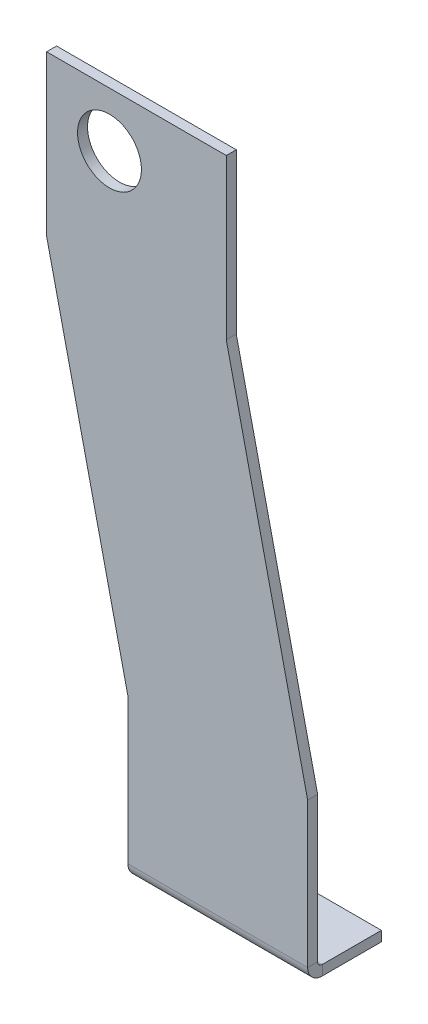
ISO-10303-21;
HEADER;
FILE_DESCRIPTION(('STEP AP214'),'2;1');
FILE_NAME('part.step','',(''),(''),'','','');
FILE_SCHEMA(('AUTOMOTIVE_DESIGN { 1 0 10303 214 1 1 1 1 }'));
ENDSEC;
DATA;
#1=APPLICATION_CONTEXT('core data for automotive mechanical design processes');
#2=APPLICATION_PROTOCOL_DEFINITION('international standard','automotive_design',2000,#1);
#3=PRODUCT_CONTEXT('',#1,'mechanical');
#4=PRODUCT('Part','Part','',(#3));
#5=PRODUCT_RELATED_PRODUCT_CATEGORY('part','',(#4));
#6=PRODUCT_DEFINITION_FORMATION('','',#4);
#7=PRODUCT_DEFINITION_CONTEXT('part definition',#1,'design');
#8=PRODUCT_DEFINITION('design','',#6,#7);
#9=PRODUCT_DEFINITION_SHAPE('','',#8);
#10=(LENGTH_UNIT() NAMED_UNIT(*) SI_UNIT(.MILLI.,.METRE.));
#11=(NAMED_UNIT(*) PLANE_ANGLE_UNIT() SI_UNIT($,.RADIAN.));
#12=(NAMED_UNIT(*) SI_UNIT($,.STERADIAN.) SOLID_ANGLE_UNIT());
#13=UNCERTAINTY_MEASURE_WITH_UNIT(LENGTH_MEASURE(1.E-05),#10,'distance_accuracy_value','');
#14=(GEOMETRIC_REPRESENTATION_CONTEXT(3) GLOBAL_UNCERTAINTY_ASSIGNED_CONTEXT((#13)) GLOBAL_UNIT_ASSIGNED_CONTEXT((#10,
#11,#12)) REPRESENTATION_CONTEXT('',''));
#15=CARTESIAN_POINT('',(0.,0.,0.));
#16=DIRECTION('',(0.,0.,1.));
#17=DIRECTION('',(1.,0.,0.));
#18=AXIS2_PLACEMENT_3D('',#15,#16,#17);
#19=CARTESIAN_POINT('',(12.93876,-82.30362,-1.5875));
#20=DIRECTION('',(-1.,0.,0.));
#21=DIRECTION('',(0.,-1.,0.));
#22=AXIS2_PLACEMENT_3D('',#19,#20,#21);
#23=PLANE('',#22);
#24=DIRECTION('',(0.,-1.,0.));
#25=VECTOR('',#24,1.);
#26=CARTESIAN_POINT('',(12.93876,-82.30362,-1.5875));
#27=LINE('',#26,#25);
#28=CARTESIAN_POINT('',(12.93876,-82.30362,-1.5875));
#29=VERTEX_POINT('',#28);
#30=CARTESIAN_POINT('',(12.93876,-105.37952,-1.58750000000001));
#31=VERTEX_POINT('',#30);
#32=EDGE_CURVE('E157',#29,#31,#27,.T.);
#33=ORIENTED_EDGE('',*,*,#32,.T.);
#34=DIRECTION('',(0.,0.,1.));
#35=VECTOR('',#34,1.);
#36=CARTESIAN_POINT('',(12.93876,-105.37952,-1.58750000000001));
#37=LINE('',#36,#35);
#38=CARTESIAN_POINT('',(12.93876,-105.37952,0.));
#39=VERTEX_POINT('',#38);
#40=EDGE_CURVE('E233',#31,#39,#37,.T.);
#41=ORIENTED_EDGE('',*,*,#40,.T.);
#42=DIRECTION('',(0.,-1.,0.));
#43=VECTOR('',#42,1.);
#44=CARTESIAN_POINT('',(12.93876,-82.30362,0.));
#45=LINE('',#44,#43);
#46=CARTESIAN_POINT('',(12.93876,-82.30362,0.));
#47=VERTEX_POINT('',#46);
#48=EDGE_CURVE('E169',#47,#39,#45,.T.);
#49=ORIENTED_EDGE('',*,*,#48,.F.);
#50=DIRECTION('',(0.,0.,1.));
#51=VECTOR('',#50,1.);
#52=CARTESIAN_POINT('',(12.93876,-82.30362,-1.5875));
#53=LINE('',#52,#51);
#54=EDGE_CURVE('E182',#29,#47,#53,.T.);
#55=ORIENTED_EDGE('',*,*,#54,.F.);
#56=EDGE_LOOP('',(#33,#41,#49,#55));
#57=FACE_BOUND('',#56,.T.);
#58=ADVANCED_FACE('F61',(#57),#23,.T.);
#59=CARTESIAN_POINT('',(0.,0.,-1.5875));
#60=DIRECTION('',(0.,0.,1.));
#61=DIRECTION('',(1.,0.,0.));
#62=AXIS2_PLACEMENT_3D('',#59,#60,#61);
#63=PLANE('',#62);
#64=CARTESIAN_POINT('',(9.99998,-8.6741,-1.5875));
#65=DIRECTION('',(0.,0.,1.));
#66=DIRECTION('',(1.,0.,0.));
#67=AXIS2_PLACEMENT_3D('',#64,#65,#66);
#68=CIRCLE('',#67,5.08000000000001);
#69=CARTESIAN_POINT('',(15.07998,-8.6741,-1.5875));
#70=VERTEX_POINT('',#69);
#71=EDGE_CURVE('E166',#70,#70,#68,.T.);
#72=ORIENTED_EDGE('',*,*,#71,.T.);
#73=EDGE_LOOP('',(#72));
#74=FACE_BOUND('',#73,.T.);
#75=DIRECTION('',(-1.,0.,0.));
#76=VECTOR('',#75,1.);
#77=CARTESIAN_POINT('',(12.93876,-105.37952,-1.58750000000001));
#78=LINE('',#77,#76);
#79=CARTESIAN_POINT('',(41.51376,-105.37952,-1.58750000000001));
#80=VERTEX_POINT('',#79);
#81=EDGE_CURVE('E236',#31,#80,#78,.F.);
#82=ORIENTED_EDGE('',*,*,#81,.F.);
#83=ORIENTED_EDGE('',*,*,#32,.F.);
#84=DIRECTION('',(0.221720810035318,-0.975110189874602,0.));
#85=VECTOR('',#84,1.);
#86=CARTESIAN_POINT('',(0.,-25.4,-1.5875));
#87=LINE('',#86,#85);
#88=CARTESIAN_POINT('',(0.,-25.4,-1.5875));
#89=VERTEX_POINT('',#88);
#90=EDGE_CURVE('E246',#89,#29,#87,.T.);
#91=ORIENTED_EDGE('',*,*,#90,.F.);
#92=DIRECTION('',(0.,-1.,0.));
#93=VECTOR('',#92,1.);
#94=CARTESIAN_POINT('',(0.,0.,-1.5875));
#95=LINE('',#94,#93);
#96=CARTESIAN_POINT('',(0.,0.,-1.5875));
#97=VERTEX_POINT('',#96);
#98=EDGE_CURVE('E179',#97,#89,#95,.T.);
#99=ORIENTED_EDGE('',*,*,#98,.F.);
#100=DIRECTION('',(-1.,0.,0.));
#101=VECTOR('',#100,1.);
#102=CARTESIAN_POINT('',(0.,0.,-1.5875));
#103=LINE('',#102,#101);
#104=CARTESIAN_POINT('',(28.575,0.,-1.5875));
#105=VERTEX_POINT('',#104);
#106=EDGE_CURVE('E150',#105,#97,#103,.T.);
#107=ORIENTED_EDGE('',*,*,#106,.F.);
#108=DIRECTION('',(0.,1.,0.));
#109=VECTOR('',#108,1.);
#110=CARTESIAN_POINT('',(28.575,0.,-1.5875));
#111=LINE('',#110,#109);
#112=CARTESIAN_POINT('',(28.575,-25.4,-1.5875));
#113=VERTEX_POINT('',#112);
#114=EDGE_CURVE('E134',#113,#105,#111,.T.);
#115=ORIENTED_EDGE('',*,*,#114,.F.);
#116=DIRECTION('',(-0.221720810035318,0.975110189874602,0.));
#117=VECTOR('',#116,1.);
#118=CARTESIAN_POINT('',(41.51376,-82.30362,-1.5875));
#119=LINE('',#118,#117);
#120=CARTESIAN_POINT('',(41.51376,-82.30362,-1.5875));
#121=VERTEX_POINT('',#120);
#122=EDGE_CURVE('E149',#121,#113,#119,.T.);
#123=ORIENTED_EDGE('',*,*,#122,.F.);
#124=DIRECTION('',(0.,1.,0.));
#125=VECTOR('',#124,1.);
#126=CARTESIAN_POINT('',(41.51376,-107.70362,-1.5875));
#127=LINE('',#126,#125);
#128=EDGE_CURVE('E155',#80,#121,#127,.T.);
#129=ORIENTED_EDGE('',*,*,#128,.F.);
#130=EDGE_LOOP('',(#82,#83,#91,#99,#107,#115,#123,#129));
#131=FACE_BOUND('',#130,.T.);
#132=ADVANCED_FACE('F147',(#74,#131),#63,.F.);
#133=CARTESIAN_POINT('',(0.,0.,0.));
#134=DIRECTION('',(0.,0.,1.));
#135=DIRECTION('',(1.,0.,0.));
#136=AXIS2_PLACEMENT_3D('',#133,#134,#135);
#137=PLANE('',#136);
#138=CARTESIAN_POINT('',(9.99998,-8.6741,0.));
#139=DIRECTION('',(0.,0.,1.));
#140=DIRECTION('',(1.,0.,0.));
#141=AXIS2_PLACEMENT_3D('',#138,#139,#140);
#142=CIRCLE('',#141,5.08000000000001);
#143=CARTESIAN_POINT('',(15.07998,-8.6741,0.));
#144=VERTEX_POINT('',#143);
#145=EDGE_CURVE('E232',#144,#144,#142,.T.);
#146=ORIENTED_EDGE('',*,*,#145,.F.);
#147=EDGE_LOOP('',(#146));
#148=FACE_BOUND('',#147,.T.);
#149=ORIENTED_EDGE('',*,*,#48,.T.);
#150=DIRECTION('',(-1.,0.,0.));
#151=VECTOR('',#150,1.);
#152=CARTESIAN_POINT('',(12.93876,-105.37952,0.));
#153=LINE('',#152,#151);
#154=CARTESIAN_POINT('',(41.51376,-105.37952,0.));
#155=VERTEX_POINT('',#154);
#156=EDGE_CURVE('E261',#39,#155,#153,.F.);
#157=ORIENTED_EDGE('',*,*,#156,.T.);
#158=DIRECTION('',(0.,1.,0.));
#159=VECTOR('',#158,1.);
#160=CARTESIAN_POINT('',(41.51376,-107.70362,0.));
#161=LINE('',#160,#159);
#162=CARTESIAN_POINT('',(41.51376,-82.30362,0.));
#163=VERTEX_POINT('',#162);
#164=EDGE_CURVE('E172',#155,#163,#161,.T.);
#165=ORIENTED_EDGE('',*,*,#164,.T.);
#166=DIRECTION('',(-0.221720810035318,0.975110189874602,0.));
#167=VECTOR('',#166,1.);
#168=CARTESIAN_POINT('',(41.51376,-82.30362,0.));
#169=LINE('',#168,#167);
#170=CARTESIAN_POINT('',(28.575,-25.4,0.));
#171=VERTEX_POINT('',#170);
#172=EDGE_CURVE('E174',#163,#171,#169,.T.);
#173=ORIENTED_EDGE('',*,*,#172,.T.);
#174=DIRECTION('',(0.,1.,0.));
#175=VECTOR('',#174,1.);
#176=CARTESIAN_POINT('',(28.575,0.,0.));
#177=LINE('',#176,#175);
#178=CARTESIAN_POINT('',(28.575,0.,0.));
#179=VERTEX_POINT('',#178);
#180=EDGE_CURVE('E137',#171,#179,#177,.T.);
#181=ORIENTED_EDGE('',*,*,#180,.T.);
#182=DIRECTION('',(-1.,0.,0.));
#183=VECTOR('',#182,1.);
#184=CARTESIAN_POINT('',(0.,0.,0.));
#185=LINE('',#184,#183);
#186=CARTESIAN_POINT('',(0.,0.,0.));
#187=VERTEX_POINT('',#186);
#188=EDGE_CURVE('E177',#179,#187,#185,.T.);
#189=ORIENTED_EDGE('',*,*,#188,.T.);
#190=DIRECTION('',(0.,-1.,0.));
#191=VECTOR('',#190,1.);
#192=CARTESIAN_POINT('',(0.,0.,0.));
#193=LINE('',#192,#191);
#194=CARTESIAN_POINT('',(0.,-25.4,0.));
#195=VERTEX_POINT('',#194);
#196=EDGE_CURVE('E162',#187,#195,#193,.T.);
#197=ORIENTED_EDGE('',*,*,#196,.T.);
#198=DIRECTION('',(0.221720810035318,-0.975110189874602,0.));
#199=VECTOR('',#198,1.);
#200=CARTESIAN_POINT('',(0.,-25.4,0.));
#201=LINE('',#200,#199);
#202=EDGE_CURVE('E165',#195,#47,#201,.T.);
#203=ORIENTED_EDGE('',*,*,#202,.T.);
#204=EDGE_LOOP('',(#149,#157,#165,#173,#181,#189,#197,#203));
#205=FACE_BOUND('',#204,.T.);
#206=ADVANCED_FACE('F186',(#148,#205),#137,.T.);
#207=CARTESIAN_POINT('',(0.,0.,-1.5875));
#208=DIRECTION('',(-1.,0.,0.));
#209=DIRECTION('',(0.,-1.,0.));
#210=AXIS2_PLACEMENT_3D('',#207,#208,#209);
#211=PLANE('',#210);
#212=ORIENTED_EDGE('',*,*,#196,.F.);
#213=DIRECTION('',(0.,0.,1.));
#214=VECTOR('',#213,1.);
#215=CARTESIAN_POINT('',(0.,0.,-1.5875));
#216=LINE('',#215,#214);
#217=EDGE_CURVE('E13',#97,#187,#216,.T.);
#218=ORIENTED_EDGE('',*,*,#217,.F.);
#219=ORIENTED_EDGE('',*,*,#98,.T.);
#220=DIRECTION('',(0.,0.,1.));
#221=VECTOR('',#220,1.);
#222=CARTESIAN_POINT('',(0.,-25.4,-1.5875));
#223=LINE('',#222,#221);
#224=EDGE_CURVE('E65',#89,#195,#223,.T.);
#225=ORIENTED_EDGE('',*,*,#224,.T.);
#226=EDGE_LOOP('',(#212,#218,#219,#225));
#227=FACE_BOUND('',#226,.T.);
#228=ADVANCED_FACE('F63',(#227),#211,.T.);
#229=CARTESIAN_POINT('',(0.,0.,-1.5875));
#230=DIRECTION('',(0.,1.,0.));
#231=DIRECTION('',(0.,0.,1.));
#232=AXIS2_PLACEMENT_3D('',#229,#230,#231);
#233=PLANE('',#232);
#234=ORIENTED_EDGE('',*,*,#188,.F.);
#235=DIRECTION('',(0.,0.,1.));
#236=VECTOR('',#235,1.);
#237=CARTESIAN_POINT('',(28.575,0.,-1.5875));
#238=LINE('',#237,#236);
#239=EDGE_CURVE('E70',#105,#179,#238,.T.);
#240=ORIENTED_EDGE('',*,*,#239,.F.);
#241=ORIENTED_EDGE('',*,*,#106,.T.);
#242=ORIENTED_EDGE('',*,*,#217,.T.);
#243=EDGE_LOOP('',(#234,#240,#241,#242));
#244=FACE_BOUND('',#243,.T.);
#245=ADVANCED_FACE('F187',(#244),#233,.T.);
#246=CARTESIAN_POINT('',(28.575,0.,-1.5875));
#247=DIRECTION('',(1.,0.,0.));
#248=DIRECTION('',(0.,0.,-1.));
#249=AXIS2_PLACEMENT_3D('',#246,#247,#248);
#250=PLANE('',#249);
#251=ORIENTED_EDGE('',*,*,#180,.F.);
#252=DIRECTION('',(0.,0.,1.));
#253=VECTOR('',#252,1.);
#254=CARTESIAN_POINT('',(28.575,-25.4,-1.5875));
#255=LINE('',#254,#253);
#256=EDGE_CURVE('E131',#113,#171,#255,.T.);
#257=ORIENTED_EDGE('',*,*,#256,.F.);
#258=ORIENTED_EDGE('',*,*,#114,.T.);
#259=ORIENTED_EDGE('',*,*,#239,.T.);
#260=EDGE_LOOP('',(#251,#257,#258,#259));
#261=FACE_BOUND('',#260,.T.);
#262=ADVANCED_FACE('F133',(#261),#250,.T.);
#263=CARTESIAN_POINT('',(41.51376,-82.30362,-1.5875));
#264=DIRECTION('',(0.975110189874602,0.221720810035318,0.));
#265=DIRECTION('',(-0.221720810035318,0.975110189874602,0.));
#266=AXIS2_PLACEMENT_3D('',#263,#264,#265);
#267=PLANE('',#266);
#268=ORIENTED_EDGE('',*,*,#172,.F.);
#269=DIRECTION('',(0.,0.,1.));
#270=VECTOR('',#269,1.);
#271=CARTESIAN_POINT('',(41.51376,-82.30362,-1.5875));
#272=LINE('',#271,#270);
#273=EDGE_CURVE('E142',#121,#163,#272,.T.);
#274=ORIENTED_EDGE('',*,*,#273,.F.);
#275=ORIENTED_EDGE('',*,*,#122,.T.);
#276=ORIENTED_EDGE('',*,*,#256,.T.);
#277=EDGE_LOOP('',(#268,#274,#275,#276));
#278=FACE_BOUND('',#277,.T.);
#279=ADVANCED_FACE('F153',(#278),#267,.T.);
#280=CARTESIAN_POINT('',(41.51376,-107.70362,-1.5875));
#281=DIRECTION('',(1.,0.,0.));
#282=DIRECTION('',(0.,1.,0.));
#283=AXIS2_PLACEMENT_3D('',#280,#281,#282);
#284=PLANE('',#283);
#285=DIRECTION('',(0.,0.,1.));
#286=VECTOR('',#285,1.);
#287=CARTESIAN_POINT('',(41.51376,-105.37952,-1.58750000000001));
#288=LINE('',#287,#286);
#289=EDGE_CURVE('E224',#80,#155,#288,.T.);
#290=ORIENTED_EDGE('',*,*,#289,.F.);
#291=ORIENTED_EDGE('',*,*,#128,.T.);
#292=ORIENTED_EDGE('',*,*,#273,.T.);
#293=ORIENTED_EDGE('',*,*,#164,.F.);
#294=EDGE_LOOP('',(#290,#291,#292,#293));
#295=FACE_BOUND('',#294,.T.);
#296=ADVANCED_FACE('F206',(#295),#284,.T.);
#297=CARTESIAN_POINT('',(0.,-25.4,-1.5875));
#298=DIRECTION('',(-0.975110189874602,-0.221720810035318,0.));
#299=DIRECTION('',(0.221720810035318,-0.975110189874602,0.));
#300=AXIS2_PLACEMENT_3D('',#297,#298,#299);
#301=PLANE('',#300);
#302=ORIENTED_EDGE('',*,*,#202,.F.);
#303=ORIENTED_EDGE('',*,*,#224,.F.);
#304=ORIENTED_EDGE('',*,*,#90,.T.);
#305=ORIENTED_EDGE('',*,*,#54,.T.);
#306=EDGE_LOOP('',(#302,#303,#304,#305));
#307=FACE_BOUND('',#306,.T.);
#308=ADVANCED_FACE('F184',(#307),#301,.T.);
#309=CARTESIAN_POINT('',(9.99998,-8.6741,-1.5875));
#310=DIRECTION('',(0.,0.,1.));
#311=DIRECTION('',(1.,0.,0.));
#312=AXIS2_PLACEMENT_3D('',#309,#310,#311);
#313=CYLINDRICAL_SURFACE('',#312,5.08000000000001);
#314=ORIENTED_EDGE('',*,*,#71,.F.);
#315=EDGE_LOOP('',(#314));
#316=FACE_BOUND('',#315,.T.);
#317=ORIENTED_EDGE('',*,*,#145,.T.);
#318=EDGE_LOOP('',(#317));
#319=FACE_BOUND('',#318,.T.);
#320=ADVANCED_FACE('F209',(#316,#319),#313,.F.);
#321=CARTESIAN_POINT('',(41.51376,-105.37952,-2.32410000000001));
#322=DIRECTION('',(1.,0.,0.));
#323=DIRECTION('',(0.,0.,-1.));
#324=AXIS2_PLACEMENT_3D('',#321,#322,#323);
#325=PLANE('',#324);
#326=DIRECTION('',(0.,1.,0.));
#327=VECTOR('',#326,1.);
#328=CARTESIAN_POINT('',(41.51376,-107.70362,-2.3241));
#329=LINE('',#328,#327);
#330=CARTESIAN_POINT('',(41.51376,-106.11612,-2.32410000000001));
#331=VERTEX_POINT('',#330);
#332=CARTESIAN_POINT('',(41.51376,-107.70362,-2.3241));
#333=VERTEX_POINT('',#332);
#334=EDGE_CURVE('E264',#331,#333,#329,.F.);
#335=ORIENTED_EDGE('',*,*,#334,.F.);
#336=CARTESIAN_POINT('',(41.51376,-105.37952,-2.32410000000001));
#337=DIRECTION('',(-1.,0.,0.));
#338=DIRECTION('',(0.,0.,1.));
#339=AXIS2_PLACEMENT_3D('',#336,#337,#338);
#340=CIRCLE('',#339,0.736600000000004);
#341=EDGE_CURVE('E242',#80,#331,#340,.F.);
#342=ORIENTED_EDGE('',*,*,#341,.F.);
#343=ORIENTED_EDGE('',*,*,#289,.T.);
#344=CARTESIAN_POINT('',(41.51376,-105.37952,-2.32410000000001));
#345=DIRECTION('',(-1.,0.,0.));
#346=DIRECTION('',(0.,0.,1.));
#347=AXIS2_PLACEMENT_3D('',#344,#345,#346);
#348=CIRCLE('',#347,2.3241);
#349=EDGE_CURVE('E78',#155,#333,#348,.F.);
#350=ORIENTED_EDGE('',*,*,#349,.T.);
#351=EDGE_LOOP('',(#335,#342,#343,#350));
#352=FACE_BOUND('',#351,.T.);
#353=ADVANCED_FACE('F214',(#352),#325,.T.);
#354=CARTESIAN_POINT('',(12.93876,-105.37952,-2.32410000000001));
#355=DIRECTION('',(1.,0.,0.));
#356=DIRECTION('',(0.,0.,-1.));
#357=AXIS2_PLACEMENT_3D('',#354,#355,#356);
#358=PLANE('',#357);
#359=CARTESIAN_POINT('',(12.93876,-105.37952,-2.32410000000001));
#360=DIRECTION('',(-1.,0.,0.));
#361=DIRECTION('',(0.,0.,1.));
#362=AXIS2_PLACEMENT_3D('',#359,#360,#361);
#363=CIRCLE('',#362,0.736600000000004);
#364=CARTESIAN_POINT('',(12.93876,-106.11612,-2.32410000000001));
#365=VERTEX_POINT('',#364);
#366=EDGE_CURVE('E243',#365,#31,#363,.T.);
#367=ORIENTED_EDGE('',*,*,#366,.F.);
#368=DIRECTION('',(0.,1.,0.));
#369=VECTOR('',#368,1.);
#370=CARTESIAN_POINT('',(12.93876,-106.11612,-2.32410000000001));
#371=LINE('',#370,#369);
#372=CARTESIAN_POINT('',(12.93876,-107.70362,-2.3241));
#373=VERTEX_POINT('',#372);
#374=EDGE_CURVE('E270',#365,#373,#371,.F.);
#375=ORIENTED_EDGE('',*,*,#374,.T.);
#376=CARTESIAN_POINT('',(12.93876,-105.37952,-2.32410000000001));
#377=DIRECTION('',(-1.,0.,0.));
#378=DIRECTION('',(0.,0.,1.));
#379=AXIS2_PLACEMENT_3D('',#376,#377,#378);
#380=CIRCLE('',#379,2.3241);
#381=EDGE_CURVE('E258',#373,#39,#380,.T.);
#382=ORIENTED_EDGE('',*,*,#381,.T.);
#383=ORIENTED_EDGE('',*,*,#40,.F.);
#384=EDGE_LOOP('',(#367,#375,#382,#383));
#385=FACE_BOUND('',#384,.T.);
#386=ADVANCED_FACE('F331',(#385),#358,.F.);
#387=CARTESIAN_POINT('',(12.93876,-105.37952,-2.32410000000001));
#388=DIRECTION('',(-1.,0.,0.));
#389=DIRECTION('',(0.,-1.,0.));
#390=AXIS2_PLACEMENT_3D('',#387,#388,#389);
#391=CYLINDRICAL_SURFACE('',#390,2.3241);
#392=ORIENTED_EDGE('',*,*,#156,.F.);
#393=ORIENTED_EDGE('',*,*,#381,.F.);
#394=DIRECTION('',(-1.,0.,0.));
#395=VECTOR('',#394,1.);
#396=CARTESIAN_POINT('',(41.51376,-107.70362,-2.3241));
#397=LINE('',#396,#395);
#398=EDGE_CURVE('E273',#373,#333,#397,.F.);
#399=ORIENTED_EDGE('',*,*,#398,.T.);
#400=ORIENTED_EDGE('',*,*,#349,.F.);
#401=EDGE_LOOP('',(#392,#393,#399,#400));
#402=FACE_BOUND('',#401,.T.);
#403=ADVANCED_FACE('F337',(#402),#391,.T.);
#404=CARTESIAN_POINT('',(12.93876,-105.37952,-2.32410000000001));
#405=DIRECTION('',(-1.,0.,0.));
#406=DIRECTION('',(0.,-1.,0.));
#407=AXIS2_PLACEMENT_3D('',#404,#405,#406);
#408=CYLINDRICAL_SURFACE('',#407,0.736600000000004);
#409=ORIENTED_EDGE('',*,*,#81,.T.);
#410=ORIENTED_EDGE('',*,*,#341,.T.);
#411=DIRECTION('',(-1.,0.,0.));
#412=VECTOR('',#411,1.);
#413=CARTESIAN_POINT('',(41.51376,-106.11612,-2.32410000000001));
#414=LINE('',#413,#412);
#415=EDGE_CURVE('E267',#331,#365,#414,.T.);
#416=ORIENTED_EDGE('',*,*,#415,.T.);
#417=ORIENTED_EDGE('',*,*,#366,.T.);
#418=EDGE_LOOP('',(#409,#410,#416,#417));
#419=FACE_BOUND('',#418,.T.);
#420=ADVANCED_FACE('F327',(#419),#408,.F.);
#421=CARTESIAN_POINT('',(12.93876,-107.70362,-11.72972));
#422=DIRECTION('',(1.,0.,0.));
#423=DIRECTION('',(0.,0.,-1.));
#424=AXIS2_PLACEMENT_3D('',#421,#422,#423);
#425=PLANE('',#424);
#426=ORIENTED_EDGE('',*,*,#374,.F.);
#427=DIRECTION('',(0.,0.,1.));
#428=VECTOR('',#427,1.);
#429=CARTESIAN_POINT('',(12.93876,-106.11612,-11.72972));
#430=LINE('',#429,#428);
#431=CARTESIAN_POINT('',(12.93876,-106.11612,-11.72972));
#432=VERTEX_POINT('',#431);
#433=EDGE_CURVE('E275',#365,#432,#430,.F.);
#434=ORIENTED_EDGE('',*,*,#433,.T.);
#435=DIRECTION('',(0.,1.,0.));
#436=VECTOR('',#435,1.);
#437=CARTESIAN_POINT('',(12.93876,-107.70362,-11.72972));
#438=LINE('',#437,#436);
#439=CARTESIAN_POINT('',(12.93876,-107.70362,-11.72972));
#440=VERTEX_POINT('',#439);
#441=EDGE_CURVE('E255',#440,#432,#438,.T.);
#442=ORIENTED_EDGE('',*,*,#441,.F.);
#443=DIRECTION('',(0.,0.,-1.));
#444=VECTOR('',#443,1.);
#445=CARTESIAN_POINT('',(12.93876,-107.70362,4.47661311459941E-13));
#446=LINE('',#445,#444);
#447=EDGE_CURVE('E284',#373,#440,#446,.T.);
#448=ORIENTED_EDGE('',*,*,#447,.F.);
#449=EDGE_LOOP('',(#426,#434,#442,#448));
#450=FACE_BOUND('',#449,.T.);
#451=ADVANCED_FACE('F311',(#450),#425,.F.);
#452=CARTESIAN_POINT('',(41.51376,-107.70362,-1.58749999999999));
#453=DIRECTION('',(-1.,0.,0.));
#454=DIRECTION('',(0.,0.,1.));
#455=AXIS2_PLACEMENT_3D('',#452,#453,#454);
#456=PLANE('',#455);
#457=ORIENTED_EDGE('',*,*,#334,.T.);
#458=DIRECTION('',(0.,0.,1.));
#459=VECTOR('',#458,1.);
#460=CARTESIAN_POINT('',(41.51376,-107.70362,4.47661311459941E-13));
#461=LINE('',#460,#459);
#462=CARTESIAN_POINT('',(41.51376,-107.70362,-11.72972));
#463=VERTEX_POINT('',#462);
#464=EDGE_CURVE('E290',#463,#333,#461,.T.);
#465=ORIENTED_EDGE('',*,*,#464,.F.);
#466=DIRECTION('',(0.,1.,0.));
#467=VECTOR('',#466,1.);
#468=CARTESIAN_POINT('',(41.51376,-107.70362,-11.72972));
#469=LINE('',#468,#467);
#470=CARTESIAN_POINT('',(41.51376,-106.11612,-11.72972));
#471=VERTEX_POINT('',#470);
#472=EDGE_CURVE('E293',#463,#471,#469,.T.);
#473=ORIENTED_EDGE('',*,*,#472,.T.);
#474=DIRECTION('',(0.,0.,-1.));
#475=VECTOR('',#474,1.);
#476=CARTESIAN_POINT('',(41.51376,-106.11612,-1.5875));
#477=LINE('',#476,#475);
#478=EDGE_CURVE('E281',#471,#331,#477,.F.);
#479=ORIENTED_EDGE('',*,*,#478,.T.);
#480=EDGE_LOOP('',(#457,#465,#473,#479));
#481=FACE_BOUND('',#480,.T.);
#482=ADVANCED_FACE('F334',(#481),#456,.F.);
#483=CARTESIAN_POINT('',(0.,-107.70362,4.47661311459941E-13));
#484=DIRECTION('',(0.,1.,0.));
#485=DIRECTION('',(0.,0.,1.));
#486=AXIS2_PLACEMENT_3D('',#483,#484,#485);
#487=PLANE('',#486);
#488=ORIENTED_EDGE('',*,*,#398,.F.);
#489=ORIENTED_EDGE('',*,*,#447,.T.);
#490=DIRECTION('',(1.,0.,0.));
#491=VECTOR('',#490,1.);
#492=CARTESIAN_POINT('',(0.,-107.70362,-11.72972));
#493=LINE('',#492,#491);
#494=EDGE_CURVE('E287',#440,#463,#493,.T.);
#495=ORIENTED_EDGE('',*,*,#494,.T.);
#496=ORIENTED_EDGE('',*,*,#464,.T.);
#497=EDGE_LOOP('',(#488,#489,#495,#496));
#498=FACE_BOUND('',#497,.T.);
#499=ADVANCED_FACE('F336',(#498),#487,.F.);
#500=CARTESIAN_POINT('',(0.,-106.11612,4.42118584834527E-13));
#501=DIRECTION('',(0.,1.,0.));
#502=DIRECTION('',(0.,0.,1.));
#503=AXIS2_PLACEMENT_3D('',#500,#501,#502);
#504=PLANE('',#503);
#505=ORIENTED_EDGE('',*,*,#433,.F.);
#506=ORIENTED_EDGE('',*,*,#415,.F.);
#507=ORIENTED_EDGE('',*,*,#478,.F.);
#508=DIRECTION('',(-1.,0.,0.));
#509=VECTOR('',#508,1.);
#510=CARTESIAN_POINT('',(41.51376,-106.11612,-11.72972));
#511=LINE('',#510,#509);
#512=EDGE_CURVE('E278',#432,#471,#511,.F.);
#513=ORIENTED_EDGE('',*,*,#512,.F.);
#514=EDGE_LOOP('',(#505,#506,#507,#513));
#515=FACE_BOUND('',#514,.T.);
#516=ADVANCED_FACE('F332',(#515),#504,.T.);
#517=CARTESIAN_POINT('',(41.51376,-107.70362,-11.72972));
#518=DIRECTION('',(0.,0.,1.));
#519=DIRECTION('',(0.,-1.,0.));
#520=AXIS2_PLACEMENT_3D('',#517,#518,#519);
#521=PLANE('',#520);
#522=ORIENTED_EDGE('',*,*,#512,.T.);
#523=ORIENTED_EDGE('',*,*,#472,.F.);
#524=ORIENTED_EDGE('',*,*,#494,.F.);
#525=ORIENTED_EDGE('',*,*,#441,.T.);
#526=EDGE_LOOP('',(#522,#523,#524,#525));
#527=FACE_BOUND('',#526,.T.);
#528=ADVANCED_FACE('F301',(#527),#521,.F.);
#529=CLOSED_SHELL('',(#58,#132,#206,#228,#245,#262,#279,#296,#308,#320,#353,#386,#403,#420,#451,
#482,#499,#516,#528));
#530=MANIFOLD_SOLID_BREP('B2',#529);
#531=ADVANCED_BREP_SHAPE_REPRESENTATION('',(#18,#530),#14);
#532=SHAPE_DEFINITION_REPRESENTATION(#9,#531);
ENDSEC;
END-ISO-10303-21;
